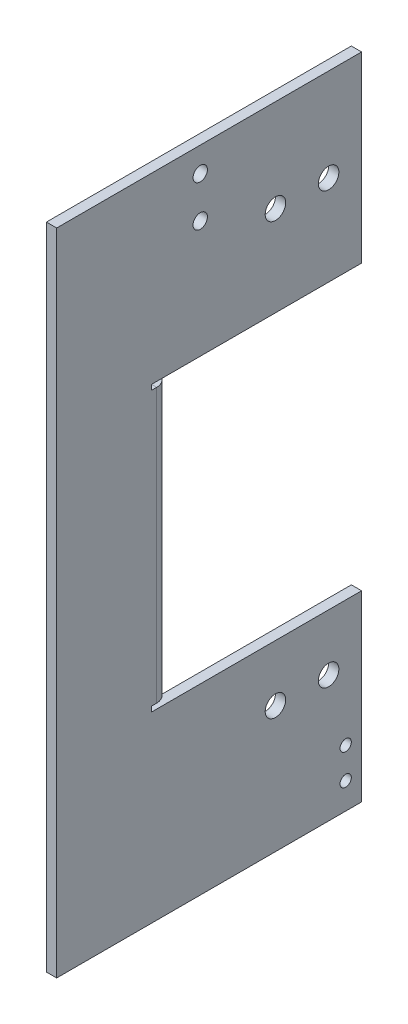
ISO-10303-21;
HEADER;
FILE_DESCRIPTION(('STEP AP214'),'2;1');
FILE_NAME('part.step','',(''),(''),'','','');
FILE_SCHEMA(('AUTOMOTIVE_DESIGN { 1 0 10303 214 1 1 1 1 }'));
ENDSEC;
DATA;
#1=APPLICATION_CONTEXT('core data for automotive mechanical design processes');
#2=APPLICATION_PROTOCOL_DEFINITION('international standard','automotive_design',2000,#1);
#3=PRODUCT_CONTEXT('',#1,'mechanical');
#4=PRODUCT('Part','Part','',(#3));
#5=PRODUCT_RELATED_PRODUCT_CATEGORY('part','',(#4));
#6=PRODUCT_DEFINITION_FORMATION('','',#4);
#7=PRODUCT_DEFINITION_CONTEXT('part definition',#1,'design');
#8=PRODUCT_DEFINITION('design','',#6,#7);
#9=PRODUCT_DEFINITION_SHAPE('','',#8);
#10=(LENGTH_UNIT() NAMED_UNIT(*) SI_UNIT(.MILLI.,.METRE.));
#11=(NAMED_UNIT(*) PLANE_ANGLE_UNIT() SI_UNIT($,.RADIAN.));
#12=(NAMED_UNIT(*) SI_UNIT($,.STERADIAN.) SOLID_ANGLE_UNIT());
#13=UNCERTAINTY_MEASURE_WITH_UNIT(LENGTH_MEASURE(1.E-05),#10,'distance_accuracy_value','');
#14=(GEOMETRIC_REPRESENTATION_CONTEXT(3) GLOBAL_UNCERTAINTY_ASSIGNED_CONTEXT((#13)) GLOBAL_UNIT_ASSIGNED_CONTEXT((#10,
#11,#12)) REPRESENTATION_CONTEXT('',''));
#15=CARTESIAN_POINT('',(0.,0.,0.));
#16=DIRECTION('',(0.,0.,1.));
#17=DIRECTION('',(1.,0.,0.));
#18=AXIS2_PLACEMENT_3D('',#15,#16,#17);
#19=CARTESIAN_POINT('',(3.,0.,-89.2));
#20=DIRECTION('',(-1.,0.,0.));
#21=DIRECTION('',(0.,0.,-1.));
#22=AXIS2_PLACEMENT_3D('',#19,#20,#21);
#23=PLANE('',#22);
#24=CARTESIAN_POINT('',(3.,16.6999999999925,-124.549999999998));
#25=DIRECTION('',(-1.,0.,0.));
#26=DIRECTION('',(0.,0.,1.));
#27=AXIS2_PLACEMENT_3D('',#24,#25,#26);
#28=CIRCLE('',#27,1.64999999999999);
#29=CARTESIAN_POINT('',(3.,16.6999999999925,-122.899999999998));
#30=VERTEX_POINT('',#29);
#31=EDGE_CURVE('E391',#30,#30,#28,.T.);
#32=ORIENTED_EDGE('',*,*,#31,.T.);
#33=EDGE_LOOP('',(#32));
#34=FACE_BOUND('',#33,.T.);
#35=CARTESIAN_POINT('',(3.,7.69999999999248,-124.549999999998));
#36=DIRECTION('',(-1.,0.,0.));
#37=DIRECTION('',(0.,0.,1.));
#38=AXIS2_PLACEMENT_3D('',#35,#36,#37);
#39=CIRCLE('',#38,1.64999999999999);
#40=CARTESIAN_POINT('',(3.,7.69999999999248,-122.899999999998));
#41=VERTEX_POINT('',#40);
#42=EDGE_CURVE('E400',#41,#41,#39,.T.);
#43=ORIENTED_EDGE('',*,*,#42,.T.);
#44=EDGE_LOOP('',(#43));
#45=FACE_BOUND('',#44,.T.);
#46=CARTESIAN_POINT('',(3.,36.9999999999958,-119.55));
#47=DIRECTION('',(-1.,0.,0.));
#48=DIRECTION('',(0.,0.,1.));
#49=AXIS2_PLACEMENT_3D('',#46,#47,#48);
#50=CIRCLE('',#49,3.00000000000001);
#51=CARTESIAN_POINT('',(3.,36.9999999999958,-116.55));
#52=VERTEX_POINT('',#51);
#53=EDGE_CURVE('E215',#52,#52,#50,.T.);
#54=ORIENTED_EDGE('',*,*,#53,.T.);
#55=EDGE_LOOP('',(#54));
#56=FACE_BOUND('',#55,.T.);
#57=CARTESIAN_POINT('',(3.,36.9999999999958,-104.));
#58=DIRECTION('',(-1.,0.,0.));
#59=DIRECTION('',(0.,0.,1.));
#60=AXIS2_PLACEMENT_3D('',#57,#58,#59);
#61=CIRCLE('',#60,3.00000000000001);
#62=CARTESIAN_POINT('',(3.,36.9999999999958,-101.));
#63=VERTEX_POINT('',#62);
#64=EDGE_CURVE('E204',#63,#63,#61,.T.);
#65=ORIENTED_EDGE('',*,*,#64,.T.);
#66=EDGE_LOOP('',(#65));
#67=FACE_BOUND('',#66,.T.);
#68=CARTESIAN_POINT('',(3.,162.91,-104.));
#69=DIRECTION('',(-1.,0.,0.));
#70=DIRECTION('',(0.,0.,1.));
#71=AXIS2_PLACEMENT_3D('',#68,#69,#70);
#72=CIRCLE('',#71,3.00000000000001);
#73=CARTESIAN_POINT('',(3.,162.91,-101.));
#74=VERTEX_POINT('',#73);
#75=EDGE_CURVE('E203',#74,#74,#72,.T.);
#76=ORIENTED_EDGE('',*,*,#75,.T.);
#77=EDGE_LOOP('',(#76));
#78=FACE_BOUND('',#77,.T.);
#79=CARTESIAN_POINT('',(3.,162.91,-119.55));
#80=DIRECTION('',(-1.,0.,0.));
#81=DIRECTION('',(0.,0.,1.));
#82=AXIS2_PLACEMENT_3D('',#79,#80,#81);
#83=CIRCLE('',#82,3.00000000000001);
#84=CARTESIAN_POINT('',(3.,162.91,-116.55));
#85=VERTEX_POINT('',#84);
#86=EDGE_CURVE('E220',#85,#85,#83,.T.);
#87=ORIENTED_EDGE('',*,*,#86,.T.);
#88=EDGE_LOOP('',(#87));
#89=FACE_BOUND('',#88,.T.);
#90=CARTESIAN_POINT('',(3.,170.770000000001,-82.0000000000004));
#91=DIRECTION('',(-1.,0.,0.));
#92=DIRECTION('',(0.,0.,1.));
#93=AXIS2_PLACEMENT_3D('',#90,#91,#92);
#94=CIRCLE('',#93,2.09999999999999);
#95=CARTESIAN_POINT('',(3.,170.770000000001,-79.9000000000004));
#96=VERTEX_POINT('',#95);
#97=EDGE_CURVE('E244',#96,#96,#94,.T.);
#98=ORIENTED_EDGE('',*,*,#97,.T.);
#99=EDGE_LOOP('',(#98));
#100=FACE_BOUND('',#99,.T.);
#101=CARTESIAN_POINT('',(3.,182.770000000001,-82.0000000000004));
#102=DIRECTION('',(-1.,0.,0.));
#103=DIRECTION('',(0.,0.,1.));
#104=AXIS2_PLACEMENT_3D('',#101,#102,#103);
#105=CIRCLE('',#104,2.09999999999999);
#106=CARTESIAN_POINT('',(3.,182.770000000001,-79.9000000000004));
#107=VERTEX_POINT('',#106);
#108=EDGE_CURVE('E250',#107,#107,#105,.T.);
#109=ORIENTED_EDGE('',*,*,#108,.T.);
#110=EDGE_LOOP('',(#109));
#111=FACE_BOUND('',#110,.T.);
#112=DIRECTION('',(0.,0.,1.));
#113=VECTOR('',#112,1.);
#114=CARTESIAN_POINT('',(3.,190.,-89.2));
#115=LINE('',#114,#113);
#116=CARTESIAN_POINT('',(3.,190.,-129.2));
#117=VERTEX_POINT('',#116);
#118=CARTESIAN_POINT('',(3.,190.,-40.));
#119=VERTEX_POINT('',#118);
#120=EDGE_CURVE('E11',#117,#119,#115,.T.);
#121=ORIENTED_EDGE('',*,*,#120,.T.);
#122=DIRECTION('',(0.,-1.,0.));
#123=VECTOR('',#122,1.);
#124=CARTESIAN_POINT('',(3.,0.,-40.));
#125=LINE('',#124,#123);
#126=CARTESIAN_POINT('',(3.,0.,-40.));
#127=VERTEX_POINT('',#126);
#128=EDGE_CURVE('E178',#119,#127,#125,.T.);
#129=ORIENTED_EDGE('',*,*,#128,.T.);
#130=DIRECTION('',(0.,0.,1.));
#131=VECTOR('',#130,1.);
#132=CARTESIAN_POINT('',(3.,0.,-89.2));
#133=LINE('',#132,#131);
#134=CARTESIAN_POINT('',(3.,0.,-129.2));
#135=VERTEX_POINT('',#134);
#136=EDGE_CURVE('E198',#135,#127,#133,.T.);
#137=ORIENTED_EDGE('',*,*,#136,.F.);
#138=DIRECTION('',(0.,1.,0.));
#139=VECTOR('',#138,1.);
#140=CARTESIAN_POINT('',(3.,53.5,-129.2));
#141=LINE('',#140,#139);
#142=CARTESIAN_POINT('',(3.,53.5,-129.2));
#143=VERTEX_POINT('',#142);
#144=EDGE_CURVE('E225',#135,#143,#141,.T.);
#145=ORIENTED_EDGE('',*,*,#144,.T.);
#146=DIRECTION('',(0.,0.,1.));
#147=VECTOR('',#146,1.);
#148=CARTESIAN_POINT('',(3.,53.5,-89.2));
#149=LINE('',#148,#147);
#150=CARTESIAN_POINT('',(3.,53.5,-67.7634));
#151=VERTEX_POINT('',#150);
#152=EDGE_CURVE('E345',#143,#151,#149,.T.);
#153=ORIENTED_EDGE('',*,*,#152,.T.);
#154=DIRECTION('',(0.,1.,0.));
#155=VECTOR('',#154,1.);
#156=CARTESIAN_POINT('',(3.,0.,-67.7634));
#157=LINE('',#156,#155);
#158=CARTESIAN_POINT('',(3.,55.,-67.7634));
#159=VERTEX_POINT('',#158);
#160=EDGE_CURVE('E370',#151,#159,#157,.T.);
#161=ORIENTED_EDGE('',*,*,#160,.T.);
#162=DIRECTION('',(0.,0.,-1.));
#163=VECTOR('',#162,1.);
#164=CARTESIAN_POINT('',(3.,55.,-89.2));
#165=LINE('',#164,#163);
#166=CARTESIAN_POINT('',(3.,55.,-69.2634));
#167=VERTEX_POINT('',#166);
#168=EDGE_CURVE('E373',#159,#167,#165,.T.);
#169=ORIENTED_EDGE('',*,*,#168,.T.);
#170=DIRECTION('',(0.,1.,0.));
#171=VECTOR('',#170,1.);
#172=CARTESIAN_POINT('',(3.,135.,-69.2634));
#173=LINE('',#172,#171);
#174=CARTESIAN_POINT('',(3.,135.,-69.2634));
#175=VERTEX_POINT('',#174);
#176=EDGE_CURVE('E320',#175,#167,#173,.F.);
#177=ORIENTED_EDGE('',*,*,#176,.F.);
#178=DIRECTION('',(0.,0.,1.));
#179=VECTOR('',#178,1.);
#180=CARTESIAN_POINT('',(3.,135.,-89.2));
#181=LINE('',#180,#179);
#182=CARTESIAN_POINT('',(3.,135.,-67.7634));
#183=VERTEX_POINT('',#182);
#184=EDGE_CURVE('E376',#175,#183,#181,.T.);
#185=ORIENTED_EDGE('',*,*,#184,.T.);
#186=DIRECTION('',(0.,1.,0.));
#187=VECTOR('',#186,1.);
#188=CARTESIAN_POINT('',(3.,0.,-67.7634));
#189=LINE('',#188,#187);
#190=CARTESIAN_POINT('',(3.,136.5,-67.7634));
#191=VERTEX_POINT('',#190);
#192=EDGE_CURVE('E379',#183,#191,#189,.T.);
#193=ORIENTED_EDGE('',*,*,#192,.T.);
#194=DIRECTION('',(0.,0.,-1.));
#195=VECTOR('',#194,1.);
#196=CARTESIAN_POINT('',(3.,136.5,-89.2));
#197=LINE('',#196,#195);
#198=CARTESIAN_POINT('',(3.,136.5,-129.2));
#199=VERTEX_POINT('',#198);
#200=EDGE_CURVE('E382',#191,#199,#197,.T.);
#201=ORIENTED_EDGE('',*,*,#200,.T.);
#202=DIRECTION('',(0.,1.,0.));
#203=VECTOR('',#202,1.);
#204=CARTESIAN_POINT('',(3.,190.,-129.2));
#205=LINE('',#204,#203);
#206=EDGE_CURVE('E240',#199,#117,#205,.T.);
#207=ORIENTED_EDGE('',*,*,#206,.T.);
#208=EDGE_LOOP('',(#121,#129,#137,#145,#153,#161,#169,#177,#185,#193,#201,#207));
#209=FACE_BOUND('',#208,.T.);
#210=ADVANCED_FACE('F38',(#34,#45,#56,#67,#78,#89,#100,#111,#209),#23,.F.);
#211=CARTESIAN_POINT('',(0.,0.,-89.2));
#212=DIRECTION('',(-1.,0.,0.));
#213=DIRECTION('',(0.,0.,-1.));
#214=AXIS2_PLACEMENT_3D('',#211,#212,#213);
#215=PLANE('',#214);
#216=DIRECTION('',(0.,-1.,0.));
#217=VECTOR('',#216,1.);
#218=CARTESIAN_POINT('',(0.,0.,-40.));
#219=LINE('',#218,#217);
#220=CARTESIAN_POINT('',(0.,190.,-40.));
#221=VERTEX_POINT('',#220);
#222=CARTESIAN_POINT('',(0.,0.,-40.));
#223=VERTEX_POINT('',#222);
#224=EDGE_CURVE('E54',#221,#223,#219,.T.);
#225=ORIENTED_EDGE('',*,*,#224,.F.);
#226=DIRECTION('',(0.,0.,1.));
#227=VECTOR('',#226,1.);
#228=CARTESIAN_POINT('',(0.,190.,-89.2));
#229=LINE('',#228,#227);
#230=CARTESIAN_POINT('',(0.,190.,-129.2));
#231=VERTEX_POINT('',#230);
#232=EDGE_CURVE('E46',#231,#221,#229,.T.);
#233=ORIENTED_EDGE('',*,*,#232,.F.);
#234=DIRECTION('',(0.,-1.,0.));
#235=VECTOR('',#234,1.);
#236=CARTESIAN_POINT('',(0.,190.,-129.2));
#237=LINE('',#236,#235);
#238=CARTESIAN_POINT('',(0.,136.5,-129.2));
#239=VERTEX_POINT('',#238);
#240=EDGE_CURVE('E236',#231,#239,#237,.T.);
#241=ORIENTED_EDGE('',*,*,#240,.T.);
#242=DIRECTION('',(0.,0.,1.));
#243=VECTOR('',#242,1.);
#244=CARTESIAN_POINT('',(0.,136.5,-73.));
#245=LINE('',#244,#243);
#246=CARTESIAN_POINT('',(0.,136.5,-67.7634));
#247=VERTEX_POINT('',#246);
#248=EDGE_CURVE('E342',#239,#247,#245,.T.);
#249=ORIENTED_EDGE('',*,*,#248,.T.);
#250=DIRECTION('',(0.,-1.,0.));
#251=VECTOR('',#250,1.);
#252=CARTESIAN_POINT('',(0.,136.5,-67.7634));
#253=LINE('',#252,#251);
#254=CARTESIAN_POINT('',(0.,135.,-67.7634));
#255=VERTEX_POINT('',#254);
#256=EDGE_CURVE('E346',#247,#255,#253,.T.);
#257=ORIENTED_EDGE('',*,*,#256,.T.);
#258=DIRECTION('',(0.,0.,-1.));
#259=VECTOR('',#258,1.);
#260=CARTESIAN_POINT('',(0.,135.,-67.7634));
#261=LINE('',#260,#259);
#262=CARTESIAN_POINT('',(0.,135.,-69.2634));
#263=VERTEX_POINT('',#262);
#264=EDGE_CURVE('E350',#255,#263,#261,.T.);
#265=ORIENTED_EDGE('',*,*,#264,.T.);
#266=DIRECTION('',(0.,1.,0.));
#267=VECTOR('',#266,1.);
#268=CARTESIAN_POINT('',(0.,135.,-69.2634));
#269=LINE('',#268,#267);
#270=CARTESIAN_POINT('',(0.,55.,-69.2634));
#271=VERTEX_POINT('',#270);
#272=EDGE_CURVE('E332',#263,#271,#269,.F.);
#273=ORIENTED_EDGE('',*,*,#272,.T.);
#274=DIRECTION('',(0.,0.,1.));
#275=VECTOR('',#274,1.);
#276=CARTESIAN_POINT('',(0.,55.,-69.2634));
#277=LINE('',#276,#275);
#278=CARTESIAN_POINT('',(0.,55.,-67.7634));
#279=VERTEX_POINT('',#278);
#280=EDGE_CURVE('E354',#271,#279,#277,.T.);
#281=ORIENTED_EDGE('',*,*,#280,.T.);
#282=DIRECTION('',(0.,-1.,0.));
#283=VECTOR('',#282,1.);
#284=CARTESIAN_POINT('',(0.,55.,-67.7634));
#285=LINE('',#284,#283);
#286=CARTESIAN_POINT('',(0.,53.5,-67.7634));
#287=VERTEX_POINT('',#286);
#288=EDGE_CURVE('E357',#279,#287,#285,.T.);
#289=ORIENTED_EDGE('',*,*,#288,.T.);
#290=DIRECTION('',(0.,0.,-1.));
#291=VECTOR('',#290,1.);
#292=CARTESIAN_POINT('',(0.,53.5,-67.7634));
#293=LINE('',#292,#291);
#294=CARTESIAN_POINT('',(0.,53.5,-129.2));
#295=VERTEX_POINT('',#294);
#296=EDGE_CURVE('E361',#287,#295,#293,.T.);
#297=ORIENTED_EDGE('',*,*,#296,.T.);
#298=DIRECTION('',(0.,-1.,0.));
#299=VECTOR('',#298,1.);
#300=CARTESIAN_POINT('',(0.,53.5,-129.2));
#301=LINE('',#300,#299);
#302=CARTESIAN_POINT('',(0.,0.,-129.2));
#303=VERTEX_POINT('',#302);
#304=EDGE_CURVE('E232',#295,#303,#301,.T.);
#305=ORIENTED_EDGE('',*,*,#304,.T.);
#306=DIRECTION('',(0.,0.,1.));
#307=VECTOR('',#306,1.);
#308=CARTESIAN_POINT('',(0.,0.,-89.2));
#309=LINE('',#308,#307);
#310=EDGE_CURVE('E192',#303,#223,#309,.T.);
#311=ORIENTED_EDGE('',*,*,#310,.T.);
#312=EDGE_LOOP('',(#225,#233,#241,#249,#257,#265,#273,#281,#289,#297,#305,#311));
#313=FACE_BOUND('',#312,.T.);
#314=CARTESIAN_POINT('',(0.,16.6999999999925,-124.549999999998));
#315=DIRECTION('',(1.,0.,0.));
#316=DIRECTION('',(0.,0.,-1.));
#317=AXIS2_PLACEMENT_3D('',#314,#315,#316);
#318=CIRCLE('',#317,1.64999999999999);
#319=CARTESIAN_POINT('',(0.,16.6999999999925,-126.199999999998));
#320=VERTEX_POINT('',#319);
#321=EDGE_CURVE('E394',#320,#320,#318,.T.);
#322=ORIENTED_EDGE('',*,*,#321,.T.);
#323=EDGE_LOOP('',(#322));
#324=FACE_BOUND('',#323,.T.);
#325=CARTESIAN_POINT('',(0.,7.69999999999248,-124.549999999998));
#326=DIRECTION('',(1.,0.,0.));
#327=DIRECTION('',(0.,0.,-1.));
#328=AXIS2_PLACEMENT_3D('',#325,#326,#327);
#329=CIRCLE('',#328,1.64999999999999);
#330=CARTESIAN_POINT('',(0.,7.69999999999248,-126.199999999998));
#331=VERTEX_POINT('',#330);
#332=EDGE_CURVE('E402',#331,#331,#329,.T.);
#333=ORIENTED_EDGE('',*,*,#332,.T.);
#334=EDGE_LOOP('',(#333));
#335=FACE_BOUND('',#334,.T.);
#336=CARTESIAN_POINT('',(0.,36.9999999999958,-119.55));
#337=DIRECTION('',(1.,0.,0.));
#338=DIRECTION('',(0.,0.,-1.));
#339=AXIS2_PLACEMENT_3D('',#336,#337,#338);
#340=CIRCLE('',#339,3.00000000000001);
#341=CARTESIAN_POINT('',(0.,36.9999999999958,-122.55));
#342=VERTEX_POINT('',#341);
#343=EDGE_CURVE('E41',#342,#342,#340,.T.);
#344=ORIENTED_EDGE('',*,*,#343,.T.);
#345=EDGE_LOOP('',(#344));
#346=FACE_BOUND('',#345,.T.);
#347=CARTESIAN_POINT('',(0.,36.9999999999958,-104.));
#348=DIRECTION('',(1.,0.,0.));
#349=DIRECTION('',(0.,0.,-1.));
#350=AXIS2_PLACEMENT_3D('',#347,#348,#349);
#351=CIRCLE('',#350,3.00000000000001);
#352=CARTESIAN_POINT('',(0.,36.9999999999958,-107.));
#353=VERTEX_POINT('',#352);
#354=EDGE_CURVE('E201',#353,#353,#351,.T.);
#355=ORIENTED_EDGE('',*,*,#354,.T.);
#356=EDGE_LOOP('',(#355));
#357=FACE_BOUND('',#356,.T.);
#358=CARTESIAN_POINT('',(0.,162.91,-104.));
#359=DIRECTION('',(-1.,0.,0.));
#360=DIRECTION('',(0.,0.,1.));
#361=AXIS2_PLACEMENT_3D('',#358,#359,#360);
#362=CIRCLE('',#361,3.00000000000001);
#363=CARTESIAN_POINT('',(0.,162.91,-101.));
#364=VERTEX_POINT('',#363);
#365=EDGE_CURVE('E208',#364,#364,#362,.T.);
#366=ORIENTED_EDGE('',*,*,#365,.F.);
#367=EDGE_LOOP('',(#366));
#368=FACE_BOUND('',#367,.T.);
#369=CARTESIAN_POINT('',(0.,162.91,-119.55));
#370=DIRECTION('',(-1.,0.,0.));
#371=DIRECTION('',(0.,0.,1.));
#372=AXIS2_PLACEMENT_3D('',#369,#370,#371);
#373=CIRCLE('',#372,3.00000000000001);
#374=CARTESIAN_POINT('',(0.,162.91,-116.55));
#375=VERTEX_POINT('',#374);
#376=EDGE_CURVE('E222',#375,#375,#373,.T.);
#377=ORIENTED_EDGE('',*,*,#376,.F.);
#378=EDGE_LOOP('',(#377));
#379=FACE_BOUND('',#378,.T.);
#380=CARTESIAN_POINT('',(0.,170.770000000001,-82.0000000000004));
#381=DIRECTION('',(1.,0.,0.));
#382=DIRECTION('',(0.,0.,-1.));
#383=AXIS2_PLACEMENT_3D('',#380,#381,#382);
#384=CIRCLE('',#383,2.09999999999999);
#385=CARTESIAN_POINT('',(0.,170.770000000001,-84.1000000000004));
#386=VERTEX_POINT('',#385);
#387=EDGE_CURVE('E247',#386,#386,#384,.T.);
#388=ORIENTED_EDGE('',*,*,#387,.T.);
#389=EDGE_LOOP('',(#388));
#390=FACE_BOUND('',#389,.T.);
#391=CARTESIAN_POINT('',(0.,182.770000000001,-82.0000000000004));
#392=DIRECTION('',(1.,0.,0.));
#393=DIRECTION('',(0.,0.,-1.));
#394=AXIS2_PLACEMENT_3D('',#391,#392,#393);
#395=CIRCLE('',#394,2.09999999999999);
#396=CARTESIAN_POINT('',(0.,182.770000000001,-84.1000000000004));
#397=VERTEX_POINT('',#396);
#398=EDGE_CURVE('E253',#397,#397,#395,.T.);
#399=ORIENTED_EDGE('',*,*,#398,.T.);
#400=EDGE_LOOP('',(#399));
#401=FACE_BOUND('',#400,.T.);
#402=ADVANCED_FACE('F187',(#313,#324,#335,#346,#357,#368,#379,#390,#401),#215,.T.);
#403=CARTESIAN_POINT('',(0.,190.,-89.2));
#404=DIRECTION('',(0.,1.,0.));
#405=DIRECTION('',(0.,0.,-1.));
#406=AXIS2_PLACEMENT_3D('',#403,#404,#405);
#407=PLANE('',#406);
#408=DIRECTION('',(-1.,0.,0.));
#409=VECTOR('',#408,1.);
#410=CARTESIAN_POINT('',(10.,190.,-40.));
#411=LINE('',#410,#409);
#412=EDGE_CURVE('E175',#119,#221,#411,.T.);
#413=ORIENTED_EDGE('',*,*,#412,.F.);
#414=ORIENTED_EDGE('',*,*,#120,.F.);
#415=DIRECTION('',(-1.,0.,0.));
#416=VECTOR('',#415,1.);
#417=CARTESIAN_POINT('',(0.,190.,-129.2));
#418=LINE('',#417,#416);
#419=EDGE_CURVE('E195',#117,#231,#418,.T.);
#420=ORIENTED_EDGE('',*,*,#419,.T.);
#421=ORIENTED_EDGE('',*,*,#232,.T.);
#422=EDGE_LOOP('',(#413,#414,#420,#421));
#423=FACE_BOUND('',#422,.T.);
#424=ADVANCED_FACE('F194',(#423),#407,.T.);
#425=CARTESIAN_POINT('',(3.,0.,-89.2));
#426=DIRECTION('',(0.,-1.,0.));
#427=DIRECTION('',(0.,0.,1.));
#428=AXIS2_PLACEMENT_3D('',#425,#426,#427);
#429=PLANE('',#428);
#430=DIRECTION('',(-1.,0.,0.));
#431=VECTOR('',#430,1.);
#432=CARTESIAN_POINT('',(10.,0.,-40.));
#433=LINE('',#432,#431);
#434=EDGE_CURVE('E182',#127,#223,#433,.T.);
#435=ORIENTED_EDGE('',*,*,#434,.T.);
#436=ORIENTED_EDGE('',*,*,#310,.F.);
#437=DIRECTION('',(1.,0.,0.));
#438=VECTOR('',#437,1.);
#439=CARTESIAN_POINT('',(3.,0.,-129.2));
#440=LINE('',#439,#438);
#441=EDGE_CURVE('E234',#303,#135,#440,.T.);
#442=ORIENTED_EDGE('',*,*,#441,.T.);
#443=ORIENTED_EDGE('',*,*,#136,.T.);
#444=EDGE_LOOP('',(#435,#436,#442,#443));
#445=FACE_BOUND('',#444,.T.);
#446=ADVANCED_FACE('F387',(#445),#429,.T.);
#447=CARTESIAN_POINT('',(0.,136.5,-73.));
#448=DIRECTION('',(0.,-1.,0.));
#449=DIRECTION('',(0.,0.,1.));
#450=AXIS2_PLACEMENT_3D('',#447,#448,#449);
#451=PLANE('',#450);
#452=DIRECTION('',(1.,0.,0.));
#453=VECTOR('',#452,1.);
#454=CARTESIAN_POINT('',(0.,136.5,-67.7634));
#455=LINE('',#454,#453);
#456=EDGE_CURVE('E349',#247,#191,#455,.T.);
#457=ORIENTED_EDGE('',*,*,#456,.F.);
#458=ORIENTED_EDGE('',*,*,#248,.F.);
#459=DIRECTION('',(1.,0.,0.));
#460=VECTOR('',#459,1.);
#461=CARTESIAN_POINT('',(0.,136.5,-129.2));
#462=LINE('',#461,#460);
#463=EDGE_CURVE('E238',#239,#199,#462,.T.);
#464=ORIENTED_EDGE('',*,*,#463,.T.);
#465=ORIENTED_EDGE('',*,*,#200,.F.);
#466=EDGE_LOOP('',(#457,#458,#464,#465));
#467=FACE_BOUND('',#466,.T.);
#468=ADVANCED_FACE('F541',(#467),#451,.T.);
#469=CARTESIAN_POINT('',(0.,136.5,-67.7634));
#470=DIRECTION('',(0.,0.,-1.));
#471=DIRECTION('',(1.,0.,0.));
#472=AXIS2_PLACEMENT_3D('',#469,#470,#471);
#473=PLANE('',#472);
#474=DIRECTION('',(1.,0.,0.));
#475=VECTOR('',#474,1.);
#476=CARTESIAN_POINT('',(0.,135.,-67.7634));
#477=LINE('',#476,#475);
#478=EDGE_CURVE('E353',#255,#183,#477,.T.);
#479=ORIENTED_EDGE('',*,*,#478,.F.);
#480=ORIENTED_EDGE('',*,*,#256,.F.);
#481=ORIENTED_EDGE('',*,*,#456,.T.);
#482=ORIENTED_EDGE('',*,*,#192,.F.);
#483=EDGE_LOOP('',(#479,#480,#481,#482));
#484=FACE_BOUND('',#483,.T.);
#485=ADVANCED_FACE('F537',(#484),#473,.T.);
#486=CARTESIAN_POINT('',(0.,135.,-67.7634));
#487=DIRECTION('',(0.,1.,0.));
#488=DIRECTION('',(0.,0.,-1.));
#489=AXIS2_PLACEMENT_3D('',#486,#487,#488);
#490=PLANE('',#489);
#491=DIRECTION('',(1.,0.,0.));
#492=VECTOR('',#491,1.);
#493=CARTESIAN_POINT('',(0.,135.,-69.2634));
#494=LINE('',#493,#492);
#495=EDGE_CURVE('E327',#263,#175,#494,.T.);
#496=ORIENTED_EDGE('',*,*,#495,.F.);
#497=ORIENTED_EDGE('',*,*,#264,.F.);
#498=ORIENTED_EDGE('',*,*,#478,.T.);
#499=ORIENTED_EDGE('',*,*,#184,.F.);
#500=EDGE_LOOP('',(#496,#497,#498,#499));
#501=FACE_BOUND('',#500,.T.);
#502=ADVANCED_FACE('F533',(#501),#490,.T.);
#503=CARTESIAN_POINT('',(0.,55.,-69.2634));
#504=DIRECTION('',(0.,-1.,0.));
#505=DIRECTION('',(0.,0.,1.));
#506=AXIS2_PLACEMENT_3D('',#503,#504,#505);
#507=PLANE('',#506);
#508=DIRECTION('',(1.,0.,0.));
#509=VECTOR('',#508,1.);
#510=CARTESIAN_POINT('',(0.,55.,-67.7634));
#511=LINE('',#510,#509);
#512=EDGE_CURVE('E360',#279,#159,#511,.T.);
#513=ORIENTED_EDGE('',*,*,#512,.F.);
#514=ORIENTED_EDGE('',*,*,#280,.F.);
#515=DIRECTION('',(1.,0.,0.));
#516=VECTOR('',#515,1.);
#517=CARTESIAN_POINT('',(0.,55.,-69.2634));
#518=LINE('',#517,#516);
#519=EDGE_CURVE('E336',#271,#167,#518,.T.);
#520=ORIENTED_EDGE('',*,*,#519,.T.);
#521=ORIENTED_EDGE('',*,*,#168,.F.);
#522=EDGE_LOOP('',(#513,#514,#520,#521));
#523=FACE_BOUND('',#522,.T.);
#524=ADVANCED_FACE('F529',(#523),#507,.T.);
#525=CARTESIAN_POINT('',(0.,55.,-67.7634));
#526=DIRECTION('',(0.,0.,-1.));
#527=DIRECTION('',(1.,0.,0.));
#528=AXIS2_PLACEMENT_3D('',#525,#526,#527);
#529=PLANE('',#528);
#530=DIRECTION('',(1.,0.,0.));
#531=VECTOR('',#530,1.);
#532=CARTESIAN_POINT('',(0.,53.5,-67.7634));
#533=LINE('',#532,#531);
#534=EDGE_CURVE('E339',#287,#151,#533,.T.);
#535=ORIENTED_EDGE('',*,*,#534,.F.);
#536=ORIENTED_EDGE('',*,*,#288,.F.);
#537=ORIENTED_EDGE('',*,*,#512,.T.);
#538=ORIENTED_EDGE('',*,*,#160,.F.);
#539=EDGE_LOOP('',(#535,#536,#537,#538));
#540=FACE_BOUND('',#539,.T.);
#541=ADVANCED_FACE('F525',(#540),#529,.T.);
#542=CARTESIAN_POINT('',(0.,53.5,-67.7634));
#543=DIRECTION('',(0.,1.,0.));
#544=DIRECTION('',(0.,0.,-1.));
#545=AXIS2_PLACEMENT_3D('',#542,#543,#544);
#546=PLANE('',#545);
#547=ORIENTED_EDGE('',*,*,#296,.F.);
#548=ORIENTED_EDGE('',*,*,#534,.T.);
#549=ORIENTED_EDGE('',*,*,#152,.F.);
#550=DIRECTION('',(-1.,0.,0.));
#551=VECTOR('',#550,1.);
#552=CARTESIAN_POINT('',(3.,53.5,-129.2));
#553=LINE('',#552,#551);
#554=EDGE_CURVE('E230',#143,#295,#553,.T.);
#555=ORIENTED_EDGE('',*,*,#554,.T.);
#556=EDGE_LOOP('',(#547,#548,#549,#555));
#557=FACE_BOUND('',#556,.T.);
#558=ADVANCED_FACE('F518',(#557),#546,.T.);
#559=CARTESIAN_POINT('',(-0.736600000000004,55.,-69.2634));
#560=DIRECTION('',(0.,-1.,0.));
#561=DIRECTION('',(0.,0.,1.));
#562=AXIS2_PLACEMENT_3D('',#559,#560,#561);
#563=PLANE('',#562);
#564=DIRECTION('',(0.,0.,-1.));
#565=VECTOR('',#564,1.);
#566=CARTESIAN_POINT('',(-0.736600000000004,55.,-73.));
#567=LINE('',#566,#565);
#568=CARTESIAN_POINT('',(-0.736600000000002,55.,-70.));
#569=VERTEX_POINT('',#568);
#570=CARTESIAN_POINT('',(-0.736599999999992,55.,-73.));
#571=VERTEX_POINT('',#570);
#572=EDGE_CURVE('E287',#569,#571,#567,.T.);
#573=ORIENTED_EDGE('',*,*,#572,.T.);
#574=CARTESIAN_POINT('',(-0.736600000000004,55.,-69.2634));
#575=DIRECTION('',(0.,-1.,0.));
#576=DIRECTION('',(0.,0.,-1.));
#577=AXIS2_PLACEMENT_3D('',#574,#575,#576);
#578=CIRCLE('',#577,3.7366);
#579=EDGE_CURVE('E323',#167,#571,#578,.F.);
#580=ORIENTED_EDGE('',*,*,#579,.F.);
#581=ORIENTED_EDGE('',*,*,#519,.F.);
#582=CARTESIAN_POINT('',(-0.736600000000004,55.,-69.2634));
#583=DIRECTION('',(0.,-1.,0.));
#584=DIRECTION('',(0.,0.,-1.));
#585=AXIS2_PLACEMENT_3D('',#582,#583,#584);
#586=CIRCLE('',#585,0.736600000000004);
#587=EDGE_CURVE('E329',#271,#569,#586,.F.);
#588=ORIENTED_EDGE('',*,*,#587,.T.);
#589=EDGE_LOOP('',(#573,#580,#581,#588));
#590=FACE_BOUND('',#589,.T.);
#591=ADVANCED_FACE('F515',(#590),#563,.T.);
#592=CARTESIAN_POINT('',(-0.736600000000004,135.,-69.2634));
#593=DIRECTION('',(0.,-1.,0.));
#594=DIRECTION('',(0.,0.,1.));
#595=AXIS2_PLACEMENT_3D('',#592,#593,#594);
#596=PLANE('',#595);
#597=CARTESIAN_POINT('',(-0.736600000000004,135.,-69.2634));
#598=DIRECTION('',(0.,-1.,0.));
#599=DIRECTION('',(0.,0.,-1.));
#600=AXIS2_PLACEMENT_3D('',#597,#598,#599);
#601=CIRCLE('',#600,0.736600000000004);
#602=CARTESIAN_POINT('',(-0.736600000000002,135.,-70.));
#603=VERTEX_POINT('',#602);
#604=EDGE_CURVE('E291',#603,#263,#601,.T.);
#605=ORIENTED_EDGE('',*,*,#604,.T.);
#606=ORIENTED_EDGE('',*,*,#495,.T.);
#607=CARTESIAN_POINT('',(-0.736600000000004,135.,-69.2634));
#608=DIRECTION('',(0.,-1.,0.));
#609=DIRECTION('',(0.,0.,-1.));
#610=AXIS2_PLACEMENT_3D('',#607,#608,#609);
#611=CIRCLE('',#610,3.7366);
#612=CARTESIAN_POINT('',(-0.736600000000004,135.,-73.));
#613=VERTEX_POINT('',#612);
#614=EDGE_CURVE('E324',#613,#175,#611,.T.);
#615=ORIENTED_EDGE('',*,*,#614,.F.);
#616=DIRECTION('',(0.,0.,-1.));
#617=VECTOR('',#616,1.);
#618=CARTESIAN_POINT('',(-0.736600000000004,135.,-70.));
#619=LINE('',#618,#617);
#620=EDGE_CURVE('E312',#603,#613,#619,.T.);
#621=ORIENTED_EDGE('',*,*,#620,.F.);
#622=EDGE_LOOP('',(#605,#606,#615,#621));
#623=FACE_BOUND('',#622,.T.);
#624=ADVANCED_FACE('F510',(#623),#596,.F.);
#625=CARTESIAN_POINT('',(-0.736600000000004,135.,-69.2634));
#626=DIRECTION('',(0.,1.,0.));
#627=DIRECTION('',(0.,0.,-1.));
#628=AXIS2_PLACEMENT_3D('',#625,#626,#627);
#629=CYLINDRICAL_SURFACE('',#628,3.7366);
#630=ORIENTED_EDGE('',*,*,#176,.T.);
#631=ORIENTED_EDGE('',*,*,#579,.T.);
#632=DIRECTION('',(0.,1.,0.));
#633=VECTOR('',#632,1.);
#634=CARTESIAN_POINT('',(-0.736600000000004,0.,-73.));
#635=LINE('',#634,#633);
#636=EDGE_CURVE('E309',#571,#613,#635,.T.);
#637=ORIENTED_EDGE('',*,*,#636,.T.);
#638=ORIENTED_EDGE('',*,*,#614,.T.);
#639=EDGE_LOOP('',(#630,#631,#637,#638));
#640=FACE_BOUND('',#639,.T.);
#641=ADVANCED_FACE('F507',(#640),#629,.T.);
#642=CARTESIAN_POINT('',(-0.736600000000004,135.,-69.2634));
#643=DIRECTION('',(0.,1.,0.));
#644=DIRECTION('',(0.,0.,-1.));
#645=AXIS2_PLACEMENT_3D('',#642,#643,#644);
#646=CYLINDRICAL_SURFACE('',#645,0.736600000000004);
#647=ORIENTED_EDGE('',*,*,#272,.F.);
#648=ORIENTED_EDGE('',*,*,#604,.F.);
#649=DIRECTION('',(0.,-1.,0.));
#650=VECTOR('',#649,1.);
#651=CARTESIAN_POINT('',(-0.736600000000004,55.,-70.));
#652=LINE('',#651,#650);
#653=EDGE_CURVE('E315',#569,#603,#652,.F.);
#654=ORIENTED_EDGE('',*,*,#653,.F.);
#655=ORIENTED_EDGE('',*,*,#587,.F.);
#656=EDGE_LOOP('',(#647,#648,#654,#655));
#657=FACE_BOUND('',#656,.T.);
#658=ADVANCED_FACE('F499',(#657),#646,.F.);
#659=CARTESIAN_POINT('',(0.,135.,-73.));
#660=DIRECTION('',(0.,1.,0.));
#661=DIRECTION('',(0.,0.,-1.));
#662=AXIS2_PLACEMENT_3D('',#659,#660,#661);
#663=PLANE('',#662);
#664=DIRECTION('',(1.,0.,0.));
#665=VECTOR('',#664,1.);
#666=CARTESIAN_POINT('',(0.,135.,-73.));
#667=LINE('',#666,#665);
#668=CARTESIAN_POINT('',(-17.,135.,-73.));
#669=VERTEX_POINT('',#668);
#670=EDGE_CURVE('E295',#669,#613,#667,.T.);
#671=ORIENTED_EDGE('',*,*,#670,.F.);
#672=DIRECTION('',(0.,0.,1.));
#673=VECTOR('',#672,1.);
#674=CARTESIAN_POINT('',(-17.,135.,-73.));
#675=LINE('',#674,#673);
#676=CARTESIAN_POINT('',(-17.,135.,-70.));
#677=VERTEX_POINT('',#676);
#678=EDGE_CURVE('E288',#669,#677,#675,.T.);
#679=ORIENTED_EDGE('',*,*,#678,.T.);
#680=DIRECTION('',(-1.,0.,0.));
#681=VECTOR('',#680,1.);
#682=CARTESIAN_POINT('',(2.38371414110695E-13,135.,-70.));
#683=LINE('',#682,#681);
#684=EDGE_CURVE('E302',#677,#603,#683,.F.);
#685=ORIENTED_EDGE('',*,*,#684,.T.);
#686=ORIENTED_EDGE('',*,*,#620,.T.);
#687=EDGE_LOOP('',(#671,#679,#685,#686));
#688=FACE_BOUND('',#687,.T.);
#689=ADVANCED_FACE('F496',(#688),#663,.T.);
#690=CARTESIAN_POINT('',(-17.,55.,-73.));
#691=DIRECTION('',(0.,-1.,0.));
#692=DIRECTION('',(0.,0.,1.));
#693=AXIS2_PLACEMENT_3D('',#690,#691,#692);
#694=PLANE('',#693);
#695=DIRECTION('',(1.,0.,0.));
#696=VECTOR('',#695,1.);
#697=CARTESIAN_POINT('',(2.38371414110695E-13,55.,-70.));
#698=LINE('',#697,#696);
#699=CARTESIAN_POINT('',(-17.,55.,-70.));
#700=VERTEX_POINT('',#699);
#701=EDGE_CURVE('E306',#569,#700,#698,.F.);
#702=ORIENTED_EDGE('',*,*,#701,.T.);
#703=DIRECTION('',(0.,0.,1.));
#704=VECTOR('',#703,1.);
#705=CARTESIAN_POINT('',(-17.,55.,-73.));
#706=LINE('',#705,#704);
#707=CARTESIAN_POINT('',(-17.,55.,-73.));
#708=VERTEX_POINT('',#707);
#709=EDGE_CURVE('E292',#708,#700,#706,.T.);
#710=ORIENTED_EDGE('',*,*,#709,.F.);
#711=DIRECTION('',(-1.,0.,0.));
#712=VECTOR('',#711,1.);
#713=CARTESIAN_POINT('',(-17.,55.,-73.));
#714=LINE('',#713,#712);
#715=EDGE_CURVE('E299',#571,#708,#714,.T.);
#716=ORIENTED_EDGE('',*,*,#715,.F.);
#717=ORIENTED_EDGE('',*,*,#572,.F.);
#718=EDGE_LOOP('',(#702,#710,#716,#717));
#719=FACE_BOUND('',#718,.T.);
#720=ADVANCED_FACE('F491',(#719),#694,.T.);
#721=CARTESIAN_POINT('',(2.48845858127225E-13,0.,-73.));
#722=DIRECTION('',(0.,0.,-1.));
#723=DIRECTION('',(1.,0.,0.));
#724=AXIS2_PLACEMENT_3D('',#721,#722,#723);
#725=PLANE('',#724);
#726=CARTESIAN_POINT('',(-9.,80.,-73.));
#727=DIRECTION('',(0.,0.,1.));
#728=DIRECTION('',(1.,0.,0.));
#729=AXIS2_PLACEMENT_3D('',#726,#727,#728);
#730=CIRCLE('',#729,2.75);
#731=CARTESIAN_POINT('',(-11.75,80.,-73.));
#732=VERTEX_POINT('',#731);
#733=CARTESIAN_POINT('',(-6.25,80.,-73.));
#734=VERTEX_POINT('',#733);
#735=EDGE_CURVE('E284',#732,#734,#730,.T.);
#736=ORIENTED_EDGE('',*,*,#735,.T.);
#737=DIRECTION('',(0.,1.,0.));
#738=VECTOR('',#737,1.);
#739=CARTESIAN_POINT('',(-6.25000000000001,0.,-73.));
#740=LINE('',#739,#738);
#741=CARTESIAN_POINT('',(-6.25,110.,-73.));
#742=VERTEX_POINT('',#741);
#743=EDGE_CURVE('E281',#734,#742,#740,.T.);
#744=ORIENTED_EDGE('',*,*,#743,.T.);
#745=CARTESIAN_POINT('',(-9.,110.,-73.));
#746=DIRECTION('',(0.,0.,1.));
#747=DIRECTION('',(1.,0.,0.));
#748=AXIS2_PLACEMENT_3D('',#745,#746,#747);
#749=CIRCLE('',#748,2.75);
#750=CARTESIAN_POINT('',(-11.75,110.,-73.));
#751=VERTEX_POINT('',#750);
#752=EDGE_CURVE('E278',#742,#751,#749,.T.);
#753=ORIENTED_EDGE('',*,*,#752,.T.);
#754=DIRECTION('',(0.,-1.,0.));
#755=VECTOR('',#754,1.);
#756=CARTESIAN_POINT('',(-11.75,0.,-73.));
#757=LINE('',#756,#755);
#758=EDGE_CURVE('E271',#751,#732,#757,.T.);
#759=ORIENTED_EDGE('',*,*,#758,.T.);
#760=EDGE_LOOP('',(#736,#744,#753,#759));
#761=FACE_BOUND('',#760,.T.);
#762=ORIENTED_EDGE('',*,*,#715,.T.);
#763=DIRECTION('',(0.,1.,0.));
#764=VECTOR('',#763,1.);
#765=CARTESIAN_POINT('',(-17.,135.,-73.));
#766=LINE('',#765,#764);
#767=EDGE_CURVE('E297',#708,#669,#766,.T.);
#768=ORIENTED_EDGE('',*,*,#767,.T.);
#769=ORIENTED_EDGE('',*,*,#670,.T.);
#770=ORIENTED_EDGE('',*,*,#636,.F.);
#771=EDGE_LOOP('',(#762,#768,#769,#770));
#772=FACE_BOUND('',#771,.T.);
#773=ADVANCED_FACE('F487',(#761,#772),#725,.T.);
#774=CARTESIAN_POINT('',(2.38371414110695E-13,0.,-70.));
#775=DIRECTION('',(0.,0.,-1.));
#776=DIRECTION('',(1.,0.,0.));
#777=AXIS2_PLACEMENT_3D('',#774,#775,#776);
#778=PLANE('',#777);
#779=DIRECTION('',(0.,1.,0.));
#780=VECTOR('',#779,1.);
#781=CARTESIAN_POINT('',(-11.75,80.,-70.));
#782=LINE('',#781,#780);
#783=CARTESIAN_POINT('',(-11.75,80.,-70.));
#784=VERTEX_POINT('',#783);
#785=CARTESIAN_POINT('',(-11.75,110.,-70.));
#786=VERTEX_POINT('',#785);
#787=EDGE_CURVE('E259',#784,#786,#782,.T.);
#788=ORIENTED_EDGE('',*,*,#787,.T.);
#789=CARTESIAN_POINT('',(-9.00000000000001,110.,-70.));
#790=DIRECTION('',(0.,0.,-1.));
#791=DIRECTION('',(1.,0.,0.));
#792=AXIS2_PLACEMENT_3D('',#789,#790,#791);
#793=CIRCLE('',#792,2.75);
#794=CARTESIAN_POINT('',(-6.25000000000001,110.,-70.));
#795=VERTEX_POINT('',#794);
#796=EDGE_CURVE('E262',#786,#795,#793,.T.);
#797=ORIENTED_EDGE('',*,*,#796,.T.);
#798=DIRECTION('',(0.,-1.,0.));
#799=VECTOR('',#798,1.);
#800=CARTESIAN_POINT('',(-6.25000000000001,80.,-70.));
#801=LINE('',#800,#799);
#802=CARTESIAN_POINT('',(-6.25000000000001,80.,-70.));
#803=VERTEX_POINT('',#802);
#804=EDGE_CURVE('E265',#795,#803,#801,.T.);
#805=ORIENTED_EDGE('',*,*,#804,.T.);
#806=CARTESIAN_POINT('',(-9.00000000000001,80.,-70.));
#807=DIRECTION('',(0.,0.,-1.));
#808=DIRECTION('',(-1.,0.,0.));
#809=AXIS2_PLACEMENT_3D('',#806,#807,#808);
#810=CIRCLE('',#809,2.75);
#811=EDGE_CURVE('E256',#803,#784,#810,.T.);
#812=ORIENTED_EDGE('',*,*,#811,.T.);
#813=EDGE_LOOP('',(#788,#797,#805,#812));
#814=FACE_BOUND('',#813,.T.);
#815=ORIENTED_EDGE('',*,*,#653,.T.);
#816=ORIENTED_EDGE('',*,*,#684,.F.);
#817=DIRECTION('',(0.,-1.,0.));
#818=VECTOR('',#817,1.);
#819=CARTESIAN_POINT('',(-17.,0.,-70.));
#820=LINE('',#819,#818);
#821=EDGE_CURVE('E304',#700,#677,#820,.F.);
#822=ORIENTED_EDGE('',*,*,#821,.F.);
#823=ORIENTED_EDGE('',*,*,#701,.F.);
#824=EDGE_LOOP('',(#815,#816,#822,#823));
#825=FACE_BOUND('',#824,.T.);
#826=ADVANCED_FACE('F490',(#814,#825),#778,.F.);
#827=CARTESIAN_POINT('',(-17.,135.,-73.));
#828=DIRECTION('',(-1.,0.,0.));
#829=DIRECTION('',(0.,0.,-1.));
#830=AXIS2_PLACEMENT_3D('',#827,#828,#829);
#831=PLANE('',#830);
#832=ORIENTED_EDGE('',*,*,#821,.T.);
#833=ORIENTED_EDGE('',*,*,#678,.F.);
#834=ORIENTED_EDGE('',*,*,#767,.F.);
#835=ORIENTED_EDGE('',*,*,#709,.T.);
#836=EDGE_LOOP('',(#832,#833,#834,#835));
#837=FACE_BOUND('',#836,.T.);
#838=ADVANCED_FACE('F485',(#837),#831,.T.);
#839=CARTESIAN_POINT('',(-8.99999999999998,80.,-80.));
#840=DIRECTION('',(0.,0.,1.));
#841=DIRECTION('',(-1.,0.,0.));
#842=AXIS2_PLACEMENT_3D('',#839,#840,#841);
#843=CYLINDRICAL_SURFACE('',#842,2.75);
#844=ORIENTED_EDGE('',*,*,#735,.F.);
#845=DIRECTION('',(0.,0.,1.));
#846=VECTOR('',#845,1.);
#847=CARTESIAN_POINT('',(-11.75,80.,-80.));
#848=LINE('',#847,#846);
#849=EDGE_CURVE('E268',#732,#784,#848,.T.);
#850=ORIENTED_EDGE('',*,*,#849,.T.);
#851=ORIENTED_EDGE('',*,*,#811,.F.);
#852=DIRECTION('',(0.,0.,1.));
#853=VECTOR('',#852,1.);
#854=CARTESIAN_POINT('',(-6.24999999999998,80.,-80.));
#855=LINE('',#854,#853);
#856=EDGE_CURVE('E269',#734,#803,#855,.T.);
#857=ORIENTED_EDGE('',*,*,#856,.F.);
#858=EDGE_LOOP('',(#844,#850,#851,#857));
#859=FACE_BOUND('',#858,.T.);
#860=ADVANCED_FACE('F479',(#859),#843,.F.);
#861=CARTESIAN_POINT('',(-6.24999999999998,80.,-80.));
#862=DIRECTION('',(1.,0.,0.));
#863=DIRECTION('',(0.,0.,1.));
#864=AXIS2_PLACEMENT_3D('',#861,#862,#863);
#865=PLANE('',#864);
#866=ORIENTED_EDGE('',*,*,#743,.F.);
#867=ORIENTED_EDGE('',*,*,#856,.T.);
#868=ORIENTED_EDGE('',*,*,#804,.F.);
#869=DIRECTION('',(0.,0.,1.));
#870=VECTOR('',#869,1.);
#871=CARTESIAN_POINT('',(-6.24999999999998,110.,-80.));
#872=LINE('',#871,#870);
#873=EDGE_CURVE('E272',#742,#795,#872,.T.);
#874=ORIENTED_EDGE('',*,*,#873,.F.);
#875=EDGE_LOOP('',(#866,#867,#868,#874));
#876=FACE_BOUND('',#875,.T.);
#877=ADVANCED_FACE('F476',(#876),#865,.F.);
#878=CARTESIAN_POINT('',(-8.99999999999998,110.,-80.));
#879=DIRECTION('',(0.,0.,1.));
#880=DIRECTION('',(-1.,0.,0.));
#881=AXIS2_PLACEMENT_3D('',#878,#879,#880);
#882=CYLINDRICAL_SURFACE('',#881,2.75);
#883=ORIENTED_EDGE('',*,*,#752,.F.);
#884=ORIENTED_EDGE('',*,*,#873,.T.);
#885=ORIENTED_EDGE('',*,*,#796,.F.);
#886=DIRECTION('',(0.,0.,1.));
#887=VECTOR('',#886,1.);
#888=CARTESIAN_POINT('',(-11.75,110.,-80.));
#889=LINE('',#888,#887);
#890=EDGE_CURVE('E62',#751,#786,#889,.T.);
#891=ORIENTED_EDGE('',*,*,#890,.F.);
#892=EDGE_LOOP('',(#883,#884,#885,#891));
#893=FACE_BOUND('',#892,.T.);
#894=ADVANCED_FACE('F471',(#893),#882,.F.);
#895=CARTESIAN_POINT('',(-11.75,80.,-80.));
#896=DIRECTION('',(-1.,0.,0.));
#897=DIRECTION('',(0.,0.,-1.));
#898=AXIS2_PLACEMENT_3D('',#895,#896,#897);
#899=PLANE('',#898);
#900=ORIENTED_EDGE('',*,*,#758,.F.);
#901=ORIENTED_EDGE('',*,*,#890,.T.);
#902=ORIENTED_EDGE('',*,*,#787,.F.);
#903=ORIENTED_EDGE('',*,*,#849,.F.);
#904=EDGE_LOOP('',(#900,#901,#902,#903));
#905=FACE_BOUND('',#904,.T.);
#906=ADVANCED_FACE('F460',(#905),#899,.F.);
#907=CARTESIAN_POINT('',(3.,182.770000000001,-82.0000000000004));
#908=DIRECTION('',(1.,0.,0.));
#909=DIRECTION('',(0.,0.,1.));
#910=AXIS2_PLACEMENT_3D('',#907,#908,#909);
#911=CYLINDRICAL_SURFACE('',#910,2.09999999999999);
#912=ORIENTED_EDGE('',*,*,#398,.F.);
#913=EDGE_LOOP('',(#912));
#914=FACE_BOUND('',#913,.T.);
#915=ORIENTED_EDGE('',*,*,#108,.F.);
#916=EDGE_LOOP('',(#915));
#917=FACE_BOUND('',#916,.T.);
#918=ADVANCED_FACE('F456',(#914,#917),#911,.F.);
#919=CARTESIAN_POINT('',(3.,170.770000000001,-82.0000000000004));
#920=DIRECTION('',(1.,0.,0.));
#921=DIRECTION('',(0.,0.,1.));
#922=AXIS2_PLACEMENT_3D('',#919,#920,#921);
#923=CYLINDRICAL_SURFACE('',#922,2.09999999999999);
#924=ORIENTED_EDGE('',*,*,#387,.F.);
#925=EDGE_LOOP('',(#924));
#926=FACE_BOUND('',#925,.T.);
#927=ORIENTED_EDGE('',*,*,#97,.F.);
#928=EDGE_LOOP('',(#927));
#929=FACE_BOUND('',#928,.T.);
#930=ADVANCED_FACE('F459',(#926,#929),#923,.F.);
#931=CARTESIAN_POINT('',(0.,0.,-129.2));
#932=DIRECTION('',(0.,0.,-1.));
#933=DIRECTION('',(1.,0.,0.));
#934=AXIS2_PLACEMENT_3D('',#931,#932,#933);
#935=PLANE('',#934);
#936=ORIENTED_EDGE('',*,*,#240,.F.);
#937=ORIENTED_EDGE('',*,*,#419,.F.);
#938=ORIENTED_EDGE('',*,*,#206,.F.);
#939=ORIENTED_EDGE('',*,*,#463,.F.);
#940=EDGE_LOOP('',(#936,#937,#938,#939));
#941=FACE_BOUND('',#940,.T.);
#942=ADVANCED_FACE('F468',(#941),#935,.T.);
#943=CARTESIAN_POINT('',(0.,0.,-129.2));
#944=DIRECTION('',(0.,0.,1.));
#945=DIRECTION('',(-1.,0.,0.));
#946=AXIS2_PLACEMENT_3D('',#943,#944,#945);
#947=PLANE('',#946);
#948=ORIENTED_EDGE('',*,*,#144,.F.);
#949=ORIENTED_EDGE('',*,*,#441,.F.);
#950=ORIENTED_EDGE('',*,*,#304,.F.);
#951=ORIENTED_EDGE('',*,*,#554,.F.);
#952=EDGE_LOOP('',(#948,#949,#950,#951));
#953=FACE_BOUND('',#952,.T.);
#954=ADVANCED_FACE('F657',(#953),#947,.F.);
#955=CARTESIAN_POINT('',(0.,162.91,-119.55));
#956=DIRECTION('',(1.,0.,0.));
#957=DIRECTION('',(0.,0.,1.));
#958=AXIS2_PLACEMENT_3D('',#955,#956,#957);
#959=CYLINDRICAL_SURFACE('',#958,3.00000000000001);
#960=ORIENTED_EDGE('',*,*,#376,.T.);
#961=EDGE_LOOP('',(#960));
#962=FACE_BOUND('',#961,.T.);
#963=ORIENTED_EDGE('',*,*,#86,.F.);
#964=EDGE_LOOP('',(#963));
#965=FACE_BOUND('',#964,.T.);
#966=ADVANCED_FACE('F666',(#962,#965),#959,.F.);
#967=CARTESIAN_POINT('',(0.,162.91,-104.));
#968=DIRECTION('',(1.,0.,0.));
#969=DIRECTION('',(0.,0.,1.));
#970=AXIS2_PLACEMENT_3D('',#967,#968,#969);
#971=CYLINDRICAL_SURFACE('',#970,3.00000000000001);
#972=ORIENTED_EDGE('',*,*,#365,.T.);
#973=EDGE_LOOP('',(#972));
#974=FACE_BOUND('',#973,.T.);
#975=ORIENTED_EDGE('',*,*,#75,.F.);
#976=EDGE_LOOP('',(#975));
#977=FACE_BOUND('',#976,.T.);
#978=ADVANCED_FACE('F423',(#974,#977),#971,.F.);
#979=CARTESIAN_POINT('',(-17.,36.9999999999958,-104.));
#980=DIRECTION('',(1.,0.,0.));
#981=DIRECTION('',(0.,0.,1.));
#982=AXIS2_PLACEMENT_3D('',#979,#980,#981);
#983=CYLINDRICAL_SURFACE('',#982,3.00000000000001);
#984=ORIENTED_EDGE('',*,*,#354,.F.);
#985=EDGE_LOOP('',(#984));
#986=FACE_BOUND('',#985,.T.);
#987=ORIENTED_EDGE('',*,*,#64,.F.);
#988=EDGE_LOOP('',(#987));
#989=FACE_BOUND('',#988,.T.);
#990=ADVANCED_FACE('F413',(#986,#989),#983,.F.);
#991=CARTESIAN_POINT('',(-17.,36.9999999999958,-119.55));
#992=DIRECTION('',(1.,0.,0.));
#993=DIRECTION('',(0.,0.,1.));
#994=AXIS2_PLACEMENT_3D('',#991,#992,#993);
#995=CYLINDRICAL_SURFACE('',#994,3.00000000000001);
#996=ORIENTED_EDGE('',*,*,#343,.F.);
#997=EDGE_LOOP('',(#996));
#998=FACE_BOUND('',#997,.T.);
#999=ORIENTED_EDGE('',*,*,#53,.F.);
#1000=EDGE_LOOP('',(#999));
#1001=FACE_BOUND('',#1000,.T.);
#1002=ADVANCED_FACE('F410',(#998,#1001),#995,.F.);
#1003=CARTESIAN_POINT('',(3.,7.69999999999248,-124.549999999998));
#1004=DIRECTION('',(1.,0.,0.));
#1005=DIRECTION('',(0.,0.,1.));
#1006=AXIS2_PLACEMENT_3D('',#1003,#1004,#1005);
#1007=CYLINDRICAL_SURFACE('',#1006,1.64999999999999);
#1008=ORIENTED_EDGE('',*,*,#332,.F.);
#1009=EDGE_LOOP('',(#1008));
#1010=FACE_BOUND('',#1009,.T.);
#1011=ORIENTED_EDGE('',*,*,#42,.F.);
#1012=EDGE_LOOP('',(#1011));
#1013=FACE_BOUND('',#1012,.T.);
#1014=ADVANCED_FACE('F412',(#1010,#1013),#1007,.F.);
#1015=CARTESIAN_POINT('',(3.,16.6999999999925,-124.549999999998));
#1016=DIRECTION('',(1.,0.,0.));
#1017=DIRECTION('',(0.,0.,1.));
#1018=AXIS2_PLACEMENT_3D('',#1015,#1016,#1017);
#1019=CYLINDRICAL_SURFACE('',#1018,1.64999999999999);
#1020=ORIENTED_EDGE('',*,*,#321,.F.);
#1021=EDGE_LOOP('',(#1020));
#1022=FACE_BOUND('',#1021,.T.);
#1023=ORIENTED_EDGE('',*,*,#31,.F.);
#1024=EDGE_LOOP('',(#1023));
#1025=FACE_BOUND('',#1024,.T.);
#1026=ADVANCED_FACE('F420',(#1022,#1025),#1019,.F.);
#1027=CARTESIAN_POINT('',(10.,0.,-40.));
#1028=DIRECTION('',(0.,0.,-1.));
#1029=DIRECTION('',(-1.,0.,0.));
#1030=AXIS2_PLACEMENT_3D('',#1027,#1028,#1029);
#1031=PLANE('',#1030);
#1032=ORIENTED_EDGE('',*,*,#412,.T.);
#1033=ORIENTED_EDGE('',*,*,#224,.T.);
#1034=ORIENTED_EDGE('',*,*,#434,.F.);
#1035=ORIENTED_EDGE('',*,*,#128,.F.);
#1036=EDGE_LOOP('',(#1032,#1033,#1034,#1035));
#1037=FACE_BOUND('',#1036,.T.);
#1038=ADVANCED_FACE('F176',(#1037),#1031,.F.);
#1039=CLOSED_SHELL('',(#210,#402,#424,#446,#468,#485,#502,#524,#541,#558,#591,#624,#641,#658,
#689,#720,#773,#826,#838,#860,#877,#894,#906,#918,#930,#942,#954,#966,#978,#990,#1002,#1014,
#1026,#1038));
#1040=MANIFOLD_SOLID_BREP('B2',#1039);
#1041=ADVANCED_BREP_SHAPE_REPRESENTATION('',(#18,#1040),#14);
#1042=SHAPE_DEFINITION_REPRESENTATION(#9,#1041);
ENDSEC;
END-ISO-10303-21;
